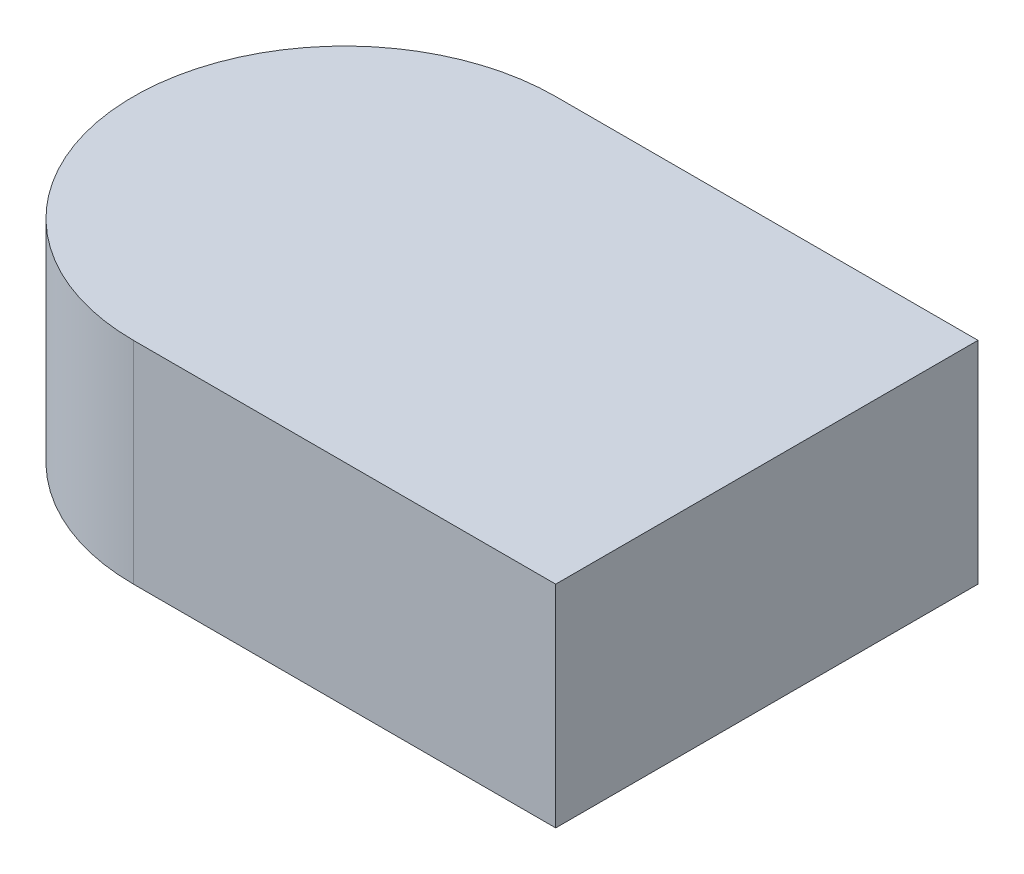
ISO-10303-21;
HEADER;
FILE_DESCRIPTION(('STEP AP214'),'2;1');
FILE_NAME('part.step','',(''),(''),'','','');
FILE_SCHEMA(('AUTOMOTIVE_DESIGN { 1 0 10303 214 1 1 1 1 }'));
ENDSEC;
DATA;
#1=APPLICATION_CONTEXT('core data for automotive mechanical design processes');
#2=APPLICATION_PROTOCOL_DEFINITION('international standard','automotive_design',2000,#1);
#3=PRODUCT_CONTEXT('',#1,'mechanical');
#4=PRODUCT('Part','Part','',(#3));
#5=PRODUCT_RELATED_PRODUCT_CATEGORY('part','',(#4));
#6=PRODUCT_DEFINITION_FORMATION('','',#4);
#7=PRODUCT_DEFINITION_CONTEXT('part definition',#1,'design');
#8=PRODUCT_DEFINITION('design','',#6,#7);
#9=PRODUCT_DEFINITION_SHAPE('','',#8);
#10=(LENGTH_UNIT() NAMED_UNIT(*) SI_UNIT(.MILLI.,.METRE.));
#11=(NAMED_UNIT(*) PLANE_ANGLE_UNIT() SI_UNIT($,.RADIAN.));
#12=(NAMED_UNIT(*) SI_UNIT($,.STERADIAN.) SOLID_ANGLE_UNIT());
#13=UNCERTAINTY_MEASURE_WITH_UNIT(LENGTH_MEASURE(1.E-05),#10,'distance_accuracy_value','');
#14=(GEOMETRIC_REPRESENTATION_CONTEXT(3) GLOBAL_UNCERTAINTY_ASSIGNED_CONTEXT((#13)) GLOBAL_UNIT_ASSIGNED_CONTEXT((#10,
#11,#12)) REPRESENTATION_CONTEXT('',''));
#15=CARTESIAN_POINT('',(0.,0.,0.));
#16=DIRECTION('',(0.,0.,1.));
#17=DIRECTION('',(1.,0.,0.));
#18=AXIS2_PLACEMENT_3D('',#15,#16,#17);
#19=CARTESIAN_POINT('',(0.,0.,0.));
#20=DIRECTION('',(0.,1.,0.));
#21=DIRECTION('',(1.,0.,0.));
#22=AXIS2_PLACEMENT_3D('',#19,#20,#21);
#23=PLANE('',#22);
#24=DIRECTION('',(0.,0.,-1.));
#25=VECTOR('',#24,1.);
#26=CARTESIAN_POINT('',(1.25,0.,-0.1));
#27=LINE('',#26,#25);
#28=CARTESIAN_POINT('',(1.25,0.,-0.1));
#29=VERTEX_POINT('',#28);
#30=CARTESIAN_POINT('',(1.25,0.,-0.3));
#31=VERTEX_POINT('',#30);
#32=EDGE_CURVE('E11',#29,#31,#27,.T.);
#33=ORIENTED_EDGE('',*,*,#32,.F.);
#34=DIRECTION('',(1.,0.,0.));
#35=VECTOR('',#34,1.);
#36=CARTESIAN_POINT('',(1.05,0.,-0.1));
#37=LINE('',#36,#35);
#38=CARTESIAN_POINT('',(1.05,0.,-0.1));
#39=VERTEX_POINT('',#38);
#40=EDGE_CURVE('E25',#39,#29,#37,.T.);
#41=ORIENTED_EDGE('',*,*,#40,.F.);
#42=CARTESIAN_POINT('',(1.05,0.,-0.2));
#43=DIRECTION('',(0.,1.,0.));
#44=DIRECTION('',(0.,0.,-1.));
#45=AXIS2_PLACEMENT_3D('',#42,#43,#44);
#46=CIRCLE('',#45,0.1);
#47=CARTESIAN_POINT('',(1.05,0.,-0.3));
#48=VERTEX_POINT('',#47);
#49=EDGE_CURVE('E73',#48,#39,#46,.T.);
#50=ORIENTED_EDGE('',*,*,#49,.F.);
#51=DIRECTION('',(-1.,0.,0.));
#52=VECTOR('',#51,1.);
#53=CARTESIAN_POINT('',(1.25,0.,-0.3));
#54=LINE('',#53,#52);
#55=EDGE_CURVE('E99',#31,#48,#54,.T.);
#56=ORIENTED_EDGE('',*,*,#55,.F.);
#57=EDGE_LOOP('',(#33,#41,#50,#56));
#58=FACE_BOUND('',#57,.T.);
#59=ADVANCED_FACE('F17',(#58),#23,.F.);
#60=CARTESIAN_POINT('',(1.25,0.,-0.3));
#61=DIRECTION('',(0.,0.,-1.));
#62=DIRECTION('',(-1.,0.,0.));
#63=AXIS2_PLACEMENT_3D('',#60,#61,#62);
#64=PLANE('',#63);
#65=DIRECTION('',(0.,1.,0.));
#66=VECTOR('',#65,1.);
#67=CARTESIAN_POINT('',(1.05,0.,-0.3));
#68=LINE('',#67,#66);
#69=CARTESIAN_POINT('',(1.05,0.1,-0.3));
#70=VERTEX_POINT('',#69);
#71=EDGE_CURVE('E95',#48,#70,#68,.T.);
#72=ORIENTED_EDGE('',*,*,#71,.T.);
#73=DIRECTION('',(-1.,0.,0.));
#74=VECTOR('',#73,1.);
#75=CARTESIAN_POINT('',(1.25,0.1,-0.3));
#76=LINE('',#75,#74);
#77=CARTESIAN_POINT('',(1.25,0.1,-0.3));
#78=VERTEX_POINT('',#77);
#79=EDGE_CURVE('E68',#78,#70,#76,.T.);
#80=ORIENTED_EDGE('',*,*,#79,.F.);
#81=DIRECTION('',(0.,1.,0.));
#82=VECTOR('',#81,1.);
#83=CARTESIAN_POINT('',(1.25,0.,-0.3));
#84=LINE('',#83,#82);
#85=EDGE_CURVE('E87',#31,#78,#84,.T.);
#86=ORIENTED_EDGE('',*,*,#85,.F.);
#87=ORIENTED_EDGE('',*,*,#55,.T.);
#88=EDGE_LOOP('',(#72,#80,#86,#87));
#89=FACE_BOUND('',#88,.T.);
#90=ADVANCED_FACE('F113',(#89),#64,.T.);
#91=CARTESIAN_POINT('',(1.25,0.,-0.1));
#92=DIRECTION('',(1.,0.,0.));
#93=DIRECTION('',(0.,0.,-1.));
#94=AXIS2_PLACEMENT_3D('',#91,#92,#93);
#95=PLANE('',#94);
#96=ORIENTED_EDGE('',*,*,#85,.T.);
#97=DIRECTION('',(0.,0.,-1.));
#98=VECTOR('',#97,1.);
#99=CARTESIAN_POINT('',(1.25,0.1,-0.1));
#100=LINE('',#99,#98);
#101=CARTESIAN_POINT('',(1.25,0.1,-0.1));
#102=VERTEX_POINT('',#101);
#103=EDGE_CURVE('E83',#102,#78,#100,.T.);
#104=ORIENTED_EDGE('',*,*,#103,.F.);
#105=DIRECTION('',(0.,1.,0.));
#106=VECTOR('',#105,1.);
#107=CARTESIAN_POINT('',(1.25,0.,-0.1));
#108=LINE('',#107,#106);
#109=EDGE_CURVE('E60',#29,#102,#108,.T.);
#110=ORIENTED_EDGE('',*,*,#109,.F.);
#111=ORIENTED_EDGE('',*,*,#32,.T.);
#112=EDGE_LOOP('',(#96,#104,#110,#111));
#113=FACE_BOUND('',#112,.T.);
#114=ADVANCED_FACE('F119',(#113),#95,.T.);
#115=CARTESIAN_POINT('',(1.05,0.,-0.1));
#116=DIRECTION('',(0.,0.,1.));
#117=DIRECTION('',(1.,0.,0.));
#118=AXIS2_PLACEMENT_3D('',#115,#116,#117);
#119=PLANE('',#118);
#120=ORIENTED_EDGE('',*,*,#109,.T.);
#121=DIRECTION('',(1.,0.,0.));
#122=VECTOR('',#121,1.);
#123=CARTESIAN_POINT('',(1.05,0.1,-0.1));
#124=LINE('',#123,#122);
#125=CARTESIAN_POINT('',(1.05,0.1,-0.1));
#126=VERTEX_POINT('',#125);
#127=EDGE_CURVE('E54',#126,#102,#124,.T.);
#128=ORIENTED_EDGE('',*,*,#127,.F.);
#129=DIRECTION('',(0.,1.,0.));
#130=VECTOR('',#129,1.);
#131=CARTESIAN_POINT('',(1.05,0.,-0.1));
#132=LINE('',#131,#130);
#133=EDGE_CURVE('E58',#39,#126,#132,.T.);
#134=ORIENTED_EDGE('',*,*,#133,.F.);
#135=ORIENTED_EDGE('',*,*,#40,.T.);
#136=EDGE_LOOP('',(#120,#128,#134,#135));
#137=FACE_BOUND('',#136,.T.);
#138=ADVANCED_FACE('F56',(#137),#119,.T.);
#139=CARTESIAN_POINT('',(1.05,0.,-0.2));
#140=DIRECTION('',(0.,1.,0.));
#141=DIRECTION('',(1.,0.,0.));
#142=AXIS2_PLACEMENT_3D('',#139,#140,#141);
#143=CYLINDRICAL_SURFACE('',#142,0.1);
#144=ORIENTED_EDGE('',*,*,#133,.T.);
#145=CARTESIAN_POINT('',(1.05,0.1,-0.2));
#146=DIRECTION('',(0.,1.,0.));
#147=DIRECTION('',(0.,0.,-1.));
#148=AXIS2_PLACEMENT_3D('',#145,#146,#147);
#149=CIRCLE('',#148,0.1);
#150=EDGE_CURVE('E66',#70,#126,#149,.T.);
#151=ORIENTED_EDGE('',*,*,#150,.F.);
#152=ORIENTED_EDGE('',*,*,#71,.F.);
#153=ORIENTED_EDGE('',*,*,#49,.T.);
#154=EDGE_LOOP('',(#144,#151,#152,#153));
#155=FACE_BOUND('',#154,.T.);
#156=ADVANCED_FACE('F72',(#155),#143,.T.);
#157=CARTESIAN_POINT('',(0.,0.1,0.));
#158=DIRECTION('',(0.,1.,0.));
#159=DIRECTION('',(1.,0.,0.));
#160=AXIS2_PLACEMENT_3D('',#157,#158,#159);
#161=PLANE('',#160);
#162=ORIENTED_EDGE('',*,*,#150,.T.);
#163=ORIENTED_EDGE('',*,*,#127,.T.);
#164=ORIENTED_EDGE('',*,*,#103,.T.);
#165=ORIENTED_EDGE('',*,*,#79,.T.);
#166=EDGE_LOOP('',(#162,#163,#164,#165));
#167=FACE_BOUND('',#166,.T.);
#168=ADVANCED_FACE('F67',(#167),#161,.T.);
#169=CLOSED_SHELL('',(#59,#90,#114,#138,#156,#168));
#170=MANIFOLD_SOLID_BREP('B1',#169);
#171=ADVANCED_BREP_SHAPE_REPRESENTATION('',(#18,#170),#14);
#172=SHAPE_DEFINITION_REPRESENTATION(#9,#171);
ENDSEC;
END-ISO-10303-21;
